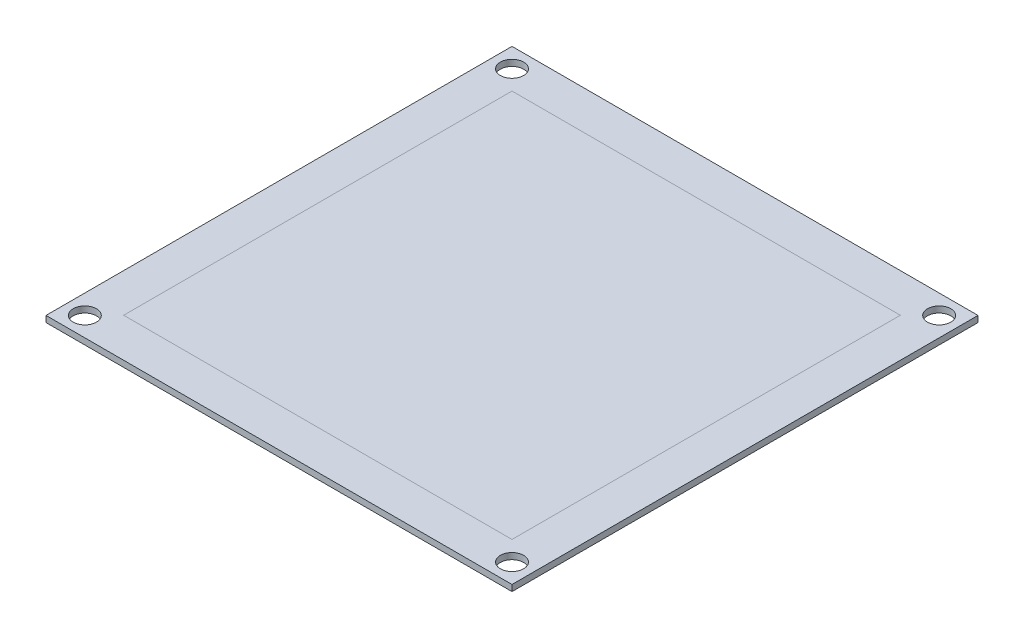
ISO-10303-21;
HEADER;
FILE_DESCRIPTION(('STEP AP214'),'2;1');
FILE_NAME('part.step','',(''),(''),'','','');
FILE_SCHEMA(('AUTOMOTIVE_DESIGN { 1 0 10303 214 1 1 1 1 }'));
ENDSEC;
DATA;
#1=APPLICATION_CONTEXT('core data for automotive mechanical design processes');
#2=APPLICATION_PROTOCOL_DEFINITION('international standard','automotive_design',2000,#1);
#3=PRODUCT_CONTEXT('',#1,'mechanical');
#4=PRODUCT('Part','Part','',(#3));
#5=PRODUCT_RELATED_PRODUCT_CATEGORY('part','',(#4));
#6=PRODUCT_DEFINITION_FORMATION('','',#4);
#7=PRODUCT_DEFINITION_CONTEXT('part definition',#1,'design');
#8=PRODUCT_DEFINITION('design','',#6,#7);
#9=PRODUCT_DEFINITION_SHAPE('','',#8);
#10=(LENGTH_UNIT() NAMED_UNIT(*) SI_UNIT(.MILLI.,.METRE.));
#11=(NAMED_UNIT(*) PLANE_ANGLE_UNIT() SI_UNIT($,.RADIAN.));
#12=(NAMED_UNIT(*) SI_UNIT($,.STERADIAN.) SOLID_ANGLE_UNIT());
#13=UNCERTAINTY_MEASURE_WITH_UNIT(LENGTH_MEASURE(1.E-05),#10,'distance_accuracy_value','');
#14=(GEOMETRIC_REPRESENTATION_CONTEXT(3) GLOBAL_UNCERTAINTY_ASSIGNED_CONTEXT((#13)) GLOBAL_UNIT_ASSIGNED_CONTEXT((#10,
#11,#12)) REPRESENTATION_CONTEXT('',''));
#15=CARTESIAN_POINT('',(0.,0.,0.));
#16=DIRECTION('',(0.,0.,1.));
#17=DIRECTION('',(1.,0.,0.));
#18=AXIS2_PLACEMENT_3D('',#15,#16,#17);
#19=CARTESIAN_POINT('',(0.,0.818,0.));
#20=DIRECTION('',(0.,1.,0.));
#21=DIRECTION('',(0.,0.,1.));
#22=AXIS2_PLACEMENT_3D('',#19,#20,#21);
#23=PLANE('',#22);
#24=DIRECTION('',(0.,0.,-1.));
#25=VECTOR('',#24,1.);
#26=CARTESIAN_POINT('',(25.,0.818,-25.));
#27=LINE('',#26,#25);
#28=CARTESIAN_POINT('',(25.,0.818,25.));
#29=VERTEX_POINT('',#28);
#30=CARTESIAN_POINT('',(25.,0.818,-25.));
#31=VERTEX_POINT('',#30);
#32=EDGE_CURVE('E59',#29,#31,#27,.T.);
#33=ORIENTED_EDGE('',*,*,#32,.T.);
#34=DIRECTION('',(-1.,0.,0.));
#35=VECTOR('',#34,1.);
#36=CARTESIAN_POINT('',(-25.,0.818,-25.));
#37=LINE('',#36,#35);
#38=CARTESIAN_POINT('',(-25.,0.818,-25.));
#39=VERTEX_POINT('',#38);
#40=EDGE_CURVE('E70',#31,#39,#37,.T.);
#41=ORIENTED_EDGE('',*,*,#40,.T.);
#42=DIRECTION('',(0.,0.,1.));
#43=VECTOR('',#42,1.);
#44=CARTESIAN_POINT('',(-25.,0.818,-25.));
#45=LINE('',#44,#43);
#46=CARTESIAN_POINT('',(-25.,0.818,25.));
#47=VERTEX_POINT('',#46);
#48=EDGE_CURVE('E55',#39,#47,#45,.T.);
#49=ORIENTED_EDGE('',*,*,#48,.T.);
#50=DIRECTION('',(1.,0.,0.));
#51=VECTOR('',#50,1.);
#52=CARTESIAN_POINT('',(-25.,0.818,25.));
#53=LINE('',#52,#51);
#54=EDGE_CURVE('E12',#47,#29,#53,.T.);
#55=ORIENTED_EDGE('',*,*,#54,.T.);
#56=EDGE_LOOP('',(#33,#41,#49,#55));
#57=FACE_BOUND('',#56,.T.);
#58=ADVANCED_FACE('F50',(#57),#23,.T.);
#59=OPEN_SHELL('',(#58));
#60=SHELL_BASED_SURFACE_MODEL('B2',(#59));
#61=CARTESIAN_POINT('',(30.,0.8,-30.));
#62=DIRECTION('',(-1.,0.,0.));
#63=DIRECTION('',(0.,0.,1.));
#64=AXIS2_PLACEMENT_3D('',#61,#62,#63);
#65=PLANE('',#64);
#66=DIRECTION('',(0.,0.,-1.));
#67=VECTOR('',#66,1.);
#68=CARTESIAN_POINT('',(30.,0.,-30.));
#69=LINE('',#68,#67);
#70=CARTESIAN_POINT('',(30.,0.,30.));
#71=VERTEX_POINT('',#70);
#72=CARTESIAN_POINT('',(30.,0.,-30.));
#73=VERTEX_POINT('',#72);
#74=EDGE_CURVE('E157',#71,#73,#69,.T.);
#75=ORIENTED_EDGE('',*,*,#74,.T.);
#76=DIRECTION('',(0.,-1.,0.));
#77=VECTOR('',#76,1.);
#78=CARTESIAN_POINT('',(30.,0.8,-30.));
#79=LINE('',#78,#77);
#80=CARTESIAN_POINT('',(30.,0.8,-30.));
#81=VERTEX_POINT('',#80);
#82=EDGE_CURVE('E48',#81,#73,#79,.T.);
#83=ORIENTED_EDGE('',*,*,#82,.F.);
#84=DIRECTION('',(0.,0.,-1.));
#85=VECTOR('',#84,1.);
#86=CARTESIAN_POINT('',(30.,0.8,-30.));
#87=LINE('',#86,#85);
#88=CARTESIAN_POINT('',(30.,0.8,30.));
#89=VERTEX_POINT('',#88);
#90=EDGE_CURVE('E145',#89,#81,#87,.T.);
#91=ORIENTED_EDGE('',*,*,#90,.F.);
#92=DIRECTION('',(0.,-1.,0.));
#93=VECTOR('',#92,1.);
#94=CARTESIAN_POINT('',(30.,0.8,30.));
#95=LINE('',#94,#93);
#96=EDGE_CURVE('E153',#89,#71,#95,.T.);
#97=ORIENTED_EDGE('',*,*,#96,.T.);
#98=EDGE_LOOP('',(#75,#83,#91,#97));
#99=FACE_BOUND('',#98,.T.);
#100=ADVANCED_FACE('F94',(#99),#65,.F.);
#101=CARTESIAN_POINT('',(-30.,0.8,-30.));
#102=DIRECTION('',(0.,0.,1.));
#103=DIRECTION('',(1.,0.,0.));
#104=AXIS2_PLACEMENT_3D('',#101,#102,#103);
#105=PLANE('',#104);
#106=DIRECTION('',(-1.,0.,0.));
#107=VECTOR('',#106,1.);
#108=CARTESIAN_POINT('',(-30.,0.,-30.));
#109=LINE('',#108,#107);
#110=CARTESIAN_POINT('',(-30.,0.,-30.));
#111=VERTEX_POINT('',#110);
#112=EDGE_CURVE('E149',#73,#111,#109,.T.);
#113=ORIENTED_EDGE('',*,*,#112,.T.);
#114=DIRECTION('',(0.,-1.,0.));
#115=VECTOR('',#114,1.);
#116=CARTESIAN_POINT('',(-30.,0.8,-30.));
#117=LINE('',#116,#115);
#118=CARTESIAN_POINT('',(-30.,0.8,-30.));
#119=VERTEX_POINT('',#118);
#120=EDGE_CURVE('E102',#119,#111,#117,.T.);
#121=ORIENTED_EDGE('',*,*,#120,.F.);
#122=DIRECTION('',(-1.,0.,0.));
#123=VECTOR('',#122,1.);
#124=CARTESIAN_POINT('',(-30.,0.8,-30.));
#125=LINE('',#124,#123);
#126=EDGE_CURVE('E140',#81,#119,#125,.T.);
#127=ORIENTED_EDGE('',*,*,#126,.F.);
#128=ORIENTED_EDGE('',*,*,#82,.T.);
#129=EDGE_LOOP('',(#113,#121,#127,#128));
#130=FACE_BOUND('',#129,.T.);
#131=ADVANCED_FACE('F148',(#130),#105,.F.);
#132=CARTESIAN_POINT('',(-30.,0.8,-30.));
#133=DIRECTION('',(1.,0.,0.));
#134=DIRECTION('',(0.,0.,-1.));
#135=AXIS2_PLACEMENT_3D('',#132,#133,#134);
#136=PLANE('',#135);
#137=DIRECTION('',(0.,0.,1.));
#138=VECTOR('',#137,1.);
#139=CARTESIAN_POINT('',(-30.,0.,-30.));
#140=LINE('',#139,#138);
#141=CARTESIAN_POINT('',(-30.,0.,30.));
#142=VERTEX_POINT('',#141);
#143=EDGE_CURVE('E127',#111,#142,#140,.T.);
#144=ORIENTED_EDGE('',*,*,#143,.T.);
#145=DIRECTION('',(0.,-1.,0.));
#146=VECTOR('',#145,1.);
#147=CARTESIAN_POINT('',(-30.,0.8,30.));
#148=LINE('',#147,#146);
#149=CARTESIAN_POINT('',(-30.,0.8,30.));
#150=VERTEX_POINT('',#149);
#151=EDGE_CURVE('E150',#150,#142,#148,.T.);
#152=ORIENTED_EDGE('',*,*,#151,.F.);
#153=DIRECTION('',(0.,0.,1.));
#154=VECTOR('',#153,1.);
#155=CARTESIAN_POINT('',(-30.,0.8,-30.));
#156=LINE('',#155,#154);
#157=EDGE_CURVE('E143',#119,#150,#156,.T.);
#158=ORIENTED_EDGE('',*,*,#157,.F.);
#159=ORIENTED_EDGE('',*,*,#120,.T.);
#160=EDGE_LOOP('',(#144,#152,#158,#159));
#161=FACE_BOUND('',#160,.T.);
#162=ADVANCED_FACE('F151',(#161),#136,.F.);
#163=CARTESIAN_POINT('',(-30.,0.8,30.));
#164=DIRECTION('',(0.,0.,-1.));
#165=DIRECTION('',(-1.,0.,0.));
#166=AXIS2_PLACEMENT_3D('',#163,#164,#165);
#167=PLANE('',#166);
#168=DIRECTION('',(1.,0.,0.));
#169=VECTOR('',#168,1.);
#170=CARTESIAN_POINT('',(-30.,0.,30.));
#171=LINE('',#170,#169);
#172=EDGE_CURVE('E133',#142,#71,#171,.T.);
#173=ORIENTED_EDGE('',*,*,#172,.T.);
#174=ORIENTED_EDGE('',*,*,#96,.F.);
#175=DIRECTION('',(1.,0.,0.));
#176=VECTOR('',#175,1.);
#177=CARTESIAN_POINT('',(-30.,0.8,30.));
#178=LINE('',#177,#176);
#179=EDGE_CURVE('E110',#150,#89,#178,.T.);
#180=ORIENTED_EDGE('',*,*,#179,.F.);
#181=ORIENTED_EDGE('',*,*,#151,.T.);
#182=EDGE_LOOP('',(#173,#174,#180,#181));
#183=FACE_BOUND('',#182,.T.);
#184=ADVANCED_FACE('F165',(#183),#167,.F.);
#185=CARTESIAN_POINT('',(0.,0.8,0.));
#186=DIRECTION('',(0.,1.,0.));
#187=DIRECTION('',(0.,0.,1.));
#188=AXIS2_PLACEMENT_3D('',#185,#186,#187);
#189=PLANE('',#188);
#190=CARTESIAN_POINT('',(-27.5,0.8,-27.5));
#191=DIRECTION('',(0.,1.,0.));
#192=DIRECTION('',(0.,0.,1.));
#193=AXIS2_PLACEMENT_3D('',#190,#191,#192);
#194=CIRCLE('',#193,1.5);
#195=CARTESIAN_POINT('',(-27.5,0.8,-26.));
#196=VERTEX_POINT('',#195);
#197=EDGE_CURVE('E191',#196,#196,#194,.T.);
#198=ORIENTED_EDGE('',*,*,#197,.F.);
#199=EDGE_LOOP('',(#198));
#200=FACE_BOUND('',#199,.T.);
#201=CARTESIAN_POINT('',(27.5,0.8,-27.5));
#202=DIRECTION('',(0.,1.,0.));
#203=DIRECTION('',(0.,0.,1.));
#204=AXIS2_PLACEMENT_3D('',#201,#202,#203);
#205=CIRCLE('',#204,1.5);
#206=CARTESIAN_POINT('',(27.5,0.8,-26.));
#207=VERTEX_POINT('',#206);
#208=EDGE_CURVE('E185',#207,#207,#205,.T.);
#209=ORIENTED_EDGE('',*,*,#208,.F.);
#210=EDGE_LOOP('',(#209));
#211=FACE_BOUND('',#210,.T.);
#212=CARTESIAN_POINT('',(27.5,0.8,27.5));
#213=DIRECTION('',(0.,1.,0.));
#214=DIRECTION('',(0.,0.,1.));
#215=AXIS2_PLACEMENT_3D('',#212,#213,#214);
#216=CIRCLE('',#215,1.5);
#217=CARTESIAN_POINT('',(27.5,0.8,29.));
#218=VERTEX_POINT('',#217);
#219=EDGE_CURVE('E179',#218,#218,#216,.T.);
#220=ORIENTED_EDGE('',*,*,#219,.F.);
#221=EDGE_LOOP('',(#220));
#222=FACE_BOUND('',#221,.T.);
#223=CARTESIAN_POINT('',(-27.5,0.8,27.5));
#224=DIRECTION('',(0.,1.,0.));
#225=DIRECTION('',(0.,0.,1.));
#226=AXIS2_PLACEMENT_3D('',#223,#224,#225);
#227=CIRCLE('',#226,1.5);
#228=CARTESIAN_POINT('',(-27.5,0.8,29.));
#229=VERTEX_POINT('',#228);
#230=EDGE_CURVE('E173',#229,#229,#227,.T.);
#231=ORIENTED_EDGE('',*,*,#230,.F.);
#232=EDGE_LOOP('',(#231));
#233=FACE_BOUND('',#232,.T.);
#234=ORIENTED_EDGE('',*,*,#90,.T.);
#235=ORIENTED_EDGE('',*,*,#126,.T.);
#236=ORIENTED_EDGE('',*,*,#157,.T.);
#237=ORIENTED_EDGE('',*,*,#179,.T.);
#238=EDGE_LOOP('',(#234,#235,#236,#237));
#239=FACE_BOUND('',#238,.T.);
#240=ADVANCED_FACE('F141',(#200,#211,#222,#233,#239),#189,.T.);
#241=CARTESIAN_POINT('',(0.,0.,0.));
#242=DIRECTION('',(0.,1.,0.));
#243=DIRECTION('',(0.,0.,1.));
#244=AXIS2_PLACEMENT_3D('',#241,#242,#243);
#245=PLANE('',#244);
#246=CARTESIAN_POINT('',(-27.5,0.,-27.5));
#247=DIRECTION('',(0.,1.,0.));
#248=DIRECTION('',(0.,0.,1.));
#249=AXIS2_PLACEMENT_3D('',#246,#247,#248);
#250=CIRCLE('',#249,1.5);
#251=CARTESIAN_POINT('',(-27.5,0.,-26.));
#252=VERTEX_POINT('',#251);
#253=EDGE_CURVE('E188',#252,#252,#250,.T.);
#254=ORIENTED_EDGE('',*,*,#253,.T.);
#255=EDGE_LOOP('',(#254));
#256=FACE_BOUND('',#255,.T.);
#257=CARTESIAN_POINT('',(27.5,0.,-27.5));
#258=DIRECTION('',(0.,1.,0.));
#259=DIRECTION('',(0.,0.,1.));
#260=AXIS2_PLACEMENT_3D('',#257,#258,#259);
#261=CIRCLE('',#260,1.5);
#262=CARTESIAN_POINT('',(27.5,0.,-26.));
#263=VERTEX_POINT('',#262);
#264=EDGE_CURVE('E182',#263,#263,#261,.T.);
#265=ORIENTED_EDGE('',*,*,#264,.T.);
#266=EDGE_LOOP('',(#265));
#267=FACE_BOUND('',#266,.T.);
#268=CARTESIAN_POINT('',(27.5,0.,27.5));
#269=DIRECTION('',(0.,1.,0.));
#270=DIRECTION('',(0.,0.,1.));
#271=AXIS2_PLACEMENT_3D('',#268,#269,#270);
#272=CIRCLE('',#271,1.5);
#273=CARTESIAN_POINT('',(27.5,0.,29.));
#274=VERTEX_POINT('',#273);
#275=EDGE_CURVE('E176',#274,#274,#272,.T.);
#276=ORIENTED_EDGE('',*,*,#275,.T.);
#277=EDGE_LOOP('',(#276));
#278=FACE_BOUND('',#277,.T.);
#279=CARTESIAN_POINT('',(-27.5,0.,27.5));
#280=DIRECTION('',(0.,1.,0.));
#281=DIRECTION('',(0.,0.,1.));
#282=AXIS2_PLACEMENT_3D('',#279,#280,#281);
#283=CIRCLE('',#282,1.5);
#284=CARTESIAN_POINT('',(-27.5,0.,29.));
#285=VERTEX_POINT('',#284);
#286=EDGE_CURVE('E160',#285,#285,#283,.T.);
#287=ORIENTED_EDGE('',*,*,#286,.T.);
#288=EDGE_LOOP('',(#287));
#289=FACE_BOUND('',#288,.T.);
#290=ORIENTED_EDGE('',*,*,#74,.F.);
#291=ORIENTED_EDGE('',*,*,#172,.F.);
#292=ORIENTED_EDGE('',*,*,#143,.F.);
#293=ORIENTED_EDGE('',*,*,#112,.F.);
#294=EDGE_LOOP('',(#290,#291,#292,#293));
#295=FACE_BOUND('',#294,.T.);
#296=ADVANCED_FACE('F168',(#256,#267,#278,#289,#295),#245,.F.);
#297=CARTESIAN_POINT('',(-27.5,0.8,27.5));
#298=DIRECTION('',(0.,1.,0.));
#299=DIRECTION('',(0.,0.,1.));
#300=AXIS2_PLACEMENT_3D('',#297,#298,#299);
#301=CYLINDRICAL_SURFACE('',#300,1.5);
#302=ORIENTED_EDGE('',*,*,#286,.F.);
#303=EDGE_LOOP('',(#302));
#304=FACE_BOUND('',#303,.T.);
#305=ORIENTED_EDGE('',*,*,#230,.T.);
#306=EDGE_LOOP('',(#305));
#307=FACE_BOUND('',#306,.T.);
#308=ADVANCED_FACE('F206',(#304,#307),#301,.F.);
#309=CARTESIAN_POINT('',(27.5,0.8,27.5));
#310=DIRECTION('',(0.,1.,0.));
#311=DIRECTION('',(0.,0.,1.));
#312=AXIS2_PLACEMENT_3D('',#309,#310,#311);
#313=CYLINDRICAL_SURFACE('',#312,1.5);
#314=ORIENTED_EDGE('',*,*,#275,.F.);
#315=EDGE_LOOP('',(#314));
#316=FACE_BOUND('',#315,.T.);
#317=ORIENTED_EDGE('',*,*,#219,.T.);
#318=EDGE_LOOP('',(#317));
#319=FACE_BOUND('',#318,.T.);
#320=ADVANCED_FACE('F208',(#316,#319),#313,.F.);
#321=CARTESIAN_POINT('',(27.5,0.8,-27.5));
#322=DIRECTION('',(0.,1.,0.));
#323=DIRECTION('',(0.,0.,1.));
#324=AXIS2_PLACEMENT_3D('',#321,#322,#323);
#325=CYLINDRICAL_SURFACE('',#324,1.5);
#326=ORIENTED_EDGE('',*,*,#264,.F.);
#327=EDGE_LOOP('',(#326));
#328=FACE_BOUND('',#327,.T.);
#329=ORIENTED_EDGE('',*,*,#208,.T.);
#330=EDGE_LOOP('',(#329));
#331=FACE_BOUND('',#330,.T.);
#332=ADVANCED_FACE('F215',(#328,#331),#325,.F.);
#333=CARTESIAN_POINT('',(-27.5,0.8,-27.5));
#334=DIRECTION('',(0.,1.,0.));
#335=DIRECTION('',(0.,0.,1.));
#336=AXIS2_PLACEMENT_3D('',#333,#334,#335);
#337=CYLINDRICAL_SURFACE('',#336,1.5);
#338=ORIENTED_EDGE('',*,*,#253,.F.);
#339=EDGE_LOOP('',(#338));
#340=FACE_BOUND('',#339,.T.);
#341=ORIENTED_EDGE('',*,*,#197,.T.);
#342=EDGE_LOOP('',(#341));
#343=FACE_BOUND('',#342,.T.);
#344=ADVANCED_FACE('F195',(#340,#343),#337,.F.);
#345=CLOSED_SHELL('',(#100,#131,#162,#184,#240,#296,#308,#320,#332,#344));
#346=MANIFOLD_SOLID_BREP('B6',#345);
#347=ADVANCED_BREP_SHAPE_REPRESENTATION('',(#18,#346),#14);
#348=MANIFOLD_SURFACE_SHAPE_REPRESENTATION('',(#18,#60),#14);
#349=SHAPE_REPRESENTATION('',(#18),#14);
#350=SHAPE_DEFINITION_REPRESENTATION(#9,#349);
#351=SHAPE_REPRESENTATION_RELATIONSHIP('','',#349,#347);
#352=SHAPE_REPRESENTATION_RELATIONSHIP('','',#349,#348);
ENDSEC;
END-ISO-10303-21;
